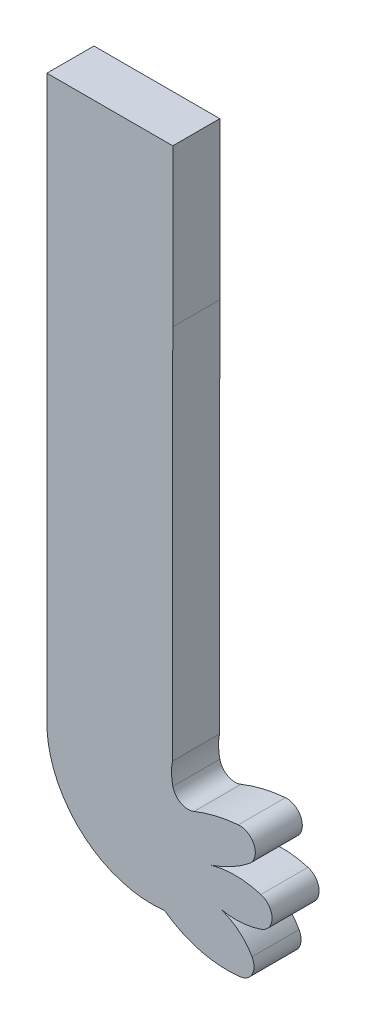
ISO-10303-21;
HEADER;
FILE_DESCRIPTION(('STEP AP214'),'2;1');
FILE_NAME('part.step','',(''),(''),'','','');
FILE_SCHEMA(('AUTOMOTIVE_DESIGN { 1 0 10303 214 1 1 1 1 }'));
ENDSEC;
DATA;
#1=APPLICATION_CONTEXT('core data for automotive mechanical design processes');
#2=APPLICATION_PROTOCOL_DEFINITION('international standard','automotive_design',2000,#1);
#3=PRODUCT_CONTEXT('',#1,'mechanical');
#4=PRODUCT('Part','Part','',(#3));
#5=PRODUCT_RELATED_PRODUCT_CATEGORY('part','',(#4));
#6=PRODUCT_DEFINITION_FORMATION('','',#4);
#7=PRODUCT_DEFINITION_CONTEXT('part definition',#1,'design');
#8=PRODUCT_DEFINITION('design','',#6,#7);
#9=PRODUCT_DEFINITION_SHAPE('','',#8);
#10=(LENGTH_UNIT() NAMED_UNIT(*) SI_UNIT(.MILLI.,.METRE.));
#11=(NAMED_UNIT(*) PLANE_ANGLE_UNIT() SI_UNIT($,.RADIAN.));
#12=(NAMED_UNIT(*) SI_UNIT($,.STERADIAN.) SOLID_ANGLE_UNIT());
#13=UNCERTAINTY_MEASURE_WITH_UNIT(LENGTH_MEASURE(1.E-05),#10,'distance_accuracy_value','');
#14=(GEOMETRIC_REPRESENTATION_CONTEXT(3) GLOBAL_UNCERTAINTY_ASSIGNED_CONTEXT((#13)) GLOBAL_UNIT_ASSIGNED_CONTEXT((#10,
#11,#12)) REPRESENTATION_CONTEXT('',''));
#15=CARTESIAN_POINT('',(0.,0.,0.));
#16=DIRECTION('',(0.,0.,1.));
#17=DIRECTION('',(1.,0.,0.));
#18=AXIS2_PLACEMENT_3D('',#15,#16,#17);
#19=CARTESIAN_POINT('',(59.8679410773858,6.18034957776012,3.));
#20=DIRECTION('',(0.,0.,-1.));
#21=DIRECTION('',(-1.,0.,0.));
#22=AXIS2_PLACEMENT_3D('',#19,#20,#21);
#23=CYLINDRICAL_SURFACE('',#22,3.53553390593273);
#24=CARTESIAN_POINT('',(59.8679410773858,6.18034957776012,0.));
#25=DIRECTION('',(0.,0.,1.));
#26=DIRECTION('',(1.,0.,0.));
#27=AXIS2_PLACEMENT_3D('',#24,#25,#26);
#28=CIRCLE('',#27,3.53553390593273);
#29=CARTESIAN_POINT('',(62.9495763407775,7.91341740777171,0.));
#30=VERTEX_POINT('',#29);
#31=CARTESIAN_POINT('',(60.8973528420917,9.56270251893659,0.));
#32=VERTEX_POINT('',#31);
#33=EDGE_CURVE('E177',#30,#32,#28,.T.);
#34=ORIENTED_EDGE('',*,*,#33,.T.);
#35=DIRECTION('',(0.,0.,-1.));
#36=VECTOR('',#35,1.);
#37=CARTESIAN_POINT('',(60.8973528420917,9.56270251893659,3.));
#38=LINE('',#37,#36);
#39=CARTESIAN_POINT('',(60.8973528420917,9.56270251893659,3.));
#40=VERTEX_POINT('',#39);
#41=EDGE_CURVE('E11',#40,#32,#38,.T.);
#42=ORIENTED_EDGE('',*,*,#41,.F.);
#43=CARTESIAN_POINT('',(59.8679410773858,6.18034957776012,3.));
#44=DIRECTION('',(0.,0.,1.));
#45=DIRECTION('',(1.,0.,0.));
#46=AXIS2_PLACEMENT_3D('',#43,#44,#45);
#47=CIRCLE('',#46,3.53553390593273);
#48=CARTESIAN_POINT('',(62.9495763407775,7.91341740777171,3.));
#49=VERTEX_POINT('',#48);
#50=EDGE_CURVE('E208',#49,#40,#47,.T.);
#51=ORIENTED_EDGE('',*,*,#50,.F.);
#52=DIRECTION('',(0.,0.,-1.));
#53=VECTOR('',#52,1.);
#54=CARTESIAN_POINT('',(62.9495763407775,7.91341740777171,3.));
#55=LINE('',#54,#53);
#56=EDGE_CURVE('E173',#49,#30,#55,.T.);
#57=ORIENTED_EDGE('',*,*,#56,.T.);
#58=EDGE_LOOP('',(#34,#42,#51,#57));
#59=FACE_BOUND('',#58,.T.);
#60=ADVANCED_FACE('F33',(#59),#23,.T.);
#61=CARTESIAN_POINT('',(61.9279452072724,14.2003681622498,3.));
#62=DIRECTION('',(0.,0.,-1.));
#63=DIRECTION('',(-1.,0.,0.));
#64=AXIS2_PLACEMENT_3D('',#61,#62,#63);
#65=CYLINDRICAL_SURFACE('',#64,4.75079606406509);
#66=CARTESIAN_POINT('',(61.9279452072724,14.2003681622498,0.));
#67=DIRECTION('',(0.,0.,1.));
#68=DIRECTION('',(1.,0.,0.));
#69=AXIS2_PLACEMENT_3D('',#66,#67,#68);
#70=CIRCLE('',#69,4.75079606406509);
#71=CARTESIAN_POINT('',(63.5166448777335,9.72308141697501,0.));
#72=VERTEX_POINT('',#71);
#73=EDGE_CURVE('E180',#32,#72,#70,.T.);
#74=ORIENTED_EDGE('',*,*,#73,.T.);
#75=DIRECTION('',(0.,0.,-1.));
#76=VECTOR('',#75,1.);
#77=CARTESIAN_POINT('',(63.5166448777335,9.72308141697501,3.));
#78=LINE('',#77,#76);
#79=CARTESIAN_POINT('',(63.5166448777335,9.72308141697501,3.));
#80=VERTEX_POINT('',#79);
#81=EDGE_CURVE('E41',#80,#72,#78,.T.);
#82=ORIENTED_EDGE('',*,*,#81,.F.);
#83=CARTESIAN_POINT('',(61.9279452072724,14.2003681622498,3.));
#84=DIRECTION('',(0.,0.,1.));
#85=DIRECTION('',(1.,0.,0.));
#86=AXIS2_PLACEMENT_3D('',#83,#84,#85);
#87=CIRCLE('',#86,4.75079606406509);
#88=EDGE_CURVE('E116',#40,#80,#87,.T.);
#89=ORIENTED_EDGE('',*,*,#88,.F.);
#90=ORIENTED_EDGE('',*,*,#41,.T.);
#91=EDGE_LOOP('',(#74,#82,#89,#90));
#92=FACE_BOUND('',#91,.T.);
#93=ADVANCED_FACE('F305',(#92),#65,.T.);
#94=CARTESIAN_POINT('',(63.2274430998222,10.6803495777602,3.));
#95=DIRECTION('',(0.,0.,-1.));
#96=DIRECTION('',(-1.,0.,0.));
#97=AXIS2_PLACEMENT_3D('',#94,#95,#96);
#98=CYLINDRICAL_SURFACE('',#97,1.00000000000002);
#99=CARTESIAN_POINT('',(63.2274430998222,10.6803495777602,0.));
#100=DIRECTION('',(0.,0.,1.));
#101=DIRECTION('',(1.,0.,0.));
#102=AXIS2_PLACEMENT_3D('',#99,#100,#101);
#103=CIRCLE('',#102,1.00000000000002);
#104=CARTESIAN_POINT('',(63.5166448777336,11.6376177385453,0.));
#105=VERTEX_POINT('',#104);
#106=EDGE_CURVE('E182',#72,#105,#103,.T.);
#107=ORIENTED_EDGE('',*,*,#106,.T.);
#108=DIRECTION('',(0.,0.,-1.));
#109=VECTOR('',#108,1.);
#110=CARTESIAN_POINT('',(63.5166448777336,11.6376177385453,3.));
#111=LINE('',#110,#109);
#112=CARTESIAN_POINT('',(63.5166448777336,11.6376177385453,3.));
#113=VERTEX_POINT('',#112);
#114=EDGE_CURVE('E239',#113,#105,#111,.T.);
#115=ORIENTED_EDGE('',*,*,#114,.F.);
#116=CARTESIAN_POINT('',(63.2274430998222,10.6803495777602,3.));
#117=DIRECTION('',(0.,0.,1.));
#118=DIRECTION('',(1.,0.,0.));
#119=AXIS2_PLACEMENT_3D('',#116,#117,#118);
#120=CIRCLE('',#119,1.00000000000002);
#121=EDGE_CURVE('E247',#80,#113,#120,.T.);
#122=ORIENTED_EDGE('',*,*,#121,.F.);
#123=ORIENTED_EDGE('',*,*,#81,.T.);
#124=EDGE_LOOP('',(#107,#115,#122,#123));
#125=FACE_BOUND('',#124,.T.);
#126=ADVANCED_FACE('F245',(#125),#98,.T.);
#127=CARTESIAN_POINT('',(61.8679410773859,6.18034957776009,3.));
#128=DIRECTION('',(0.,0.,-1.));
#129=DIRECTION('',(-1.,0.,0.));
#130=AXIS2_PLACEMENT_3D('',#127,#128,#129);
#131=CYLINDRICAL_SURFACE('',#130,5.70087712549574);
#132=CARTESIAN_POINT('',(61.8679410773859,6.18034957776009,0.));
#133=DIRECTION('',(0.,0.,1.));
#134=DIRECTION('',(1.,0.,0.));
#135=AXIS2_PLACEMENT_3D('',#132,#133,#134);
#136=CIRCLE('',#135,5.70087712549574);
#137=CARTESIAN_POINT('',(60.3679410773858,11.6803495777601,0.));
#138=VERTEX_POINT('',#137);
#139=EDGE_CURVE('E184',#105,#138,#136,.T.);
#140=ORIENTED_EDGE('',*,*,#139,.T.);
#141=DIRECTION('',(0.,0.,-1.));
#142=VECTOR('',#141,1.);
#143=CARTESIAN_POINT('',(60.3679410773858,11.6803495777601,3.));
#144=LINE('',#143,#142);
#145=CARTESIAN_POINT('',(60.3679410773858,11.6803495777601,3.));
#146=VERTEX_POINT('',#145);
#147=EDGE_CURVE('E236',#146,#138,#144,.T.);
#148=ORIENTED_EDGE('',*,*,#147,.F.);
#149=CARTESIAN_POINT('',(61.8679410773859,6.18034957776009,3.));
#150=DIRECTION('',(0.,0.,1.));
#151=DIRECTION('',(1.,0.,0.));
#152=AXIS2_PLACEMENT_3D('',#149,#150,#151);
#153=CIRCLE('',#152,5.70087712549574);
#154=EDGE_CURVE('E265',#113,#146,#153,.T.);
#155=ORIENTED_EDGE('',*,*,#154,.F.);
#156=ORIENTED_EDGE('',*,*,#114,.T.);
#157=EDGE_LOOP('',(#140,#148,#155,#156));
#158=FACE_BOUND('',#157,.T.);
#159=ADVANCED_FACE('F256',(#158),#131,.T.);
#160=CARTESIAN_POINT('',(57.8679410773858,19.18034957776,3.));
#161=DIRECTION('',(0.,0.,-1.));
#162=DIRECTION('',(-1.,0.,0.));
#163=AXIS2_PLACEMENT_3D('',#160,#161,#162);
#164=CYLINDRICAL_SURFACE('',#163,7.90569415042085);
#165=CARTESIAN_POINT('',(57.8679410773858,19.18034957776,0.));
#166=DIRECTION('',(0.,0.,1.));
#167=DIRECTION('',(1.,0.,0.));
#168=AXIS2_PLACEMENT_3D('',#165,#166,#167);
#169=CIRCLE('',#168,7.90569415042085);
#170=CARTESIAN_POINT('',(62.7790237950045,12.9850879577228,0.));
#171=VERTEX_POINT('',#170);
#172=EDGE_CURVE('E186',#138,#171,#169,.T.);
#173=ORIENTED_EDGE('',*,*,#172,.T.);
#174=DIRECTION('',(0.,0.,-1.));
#175=VECTOR('',#174,1.);
#176=CARTESIAN_POINT('',(62.7790237950045,12.9850879577228,3.));
#177=LINE('',#176,#175);
#178=CARTESIAN_POINT('',(62.7790237950045,12.9850879577228,3.));
#179=VERTEX_POINT('',#178);
#180=EDGE_CURVE('E233',#179,#171,#177,.T.);
#181=ORIENTED_EDGE('',*,*,#180,.F.);
#182=CARTESIAN_POINT('',(57.8679410773858,19.18034957776,3.));
#183=DIRECTION('',(0.,0.,1.));
#184=DIRECTION('',(1.,0.,0.));
#185=AXIS2_PLACEMENT_3D('',#182,#183,#184);
#186=CIRCLE('',#185,7.90569415042085);
#187=EDGE_CURVE('E262',#146,#179,#186,.T.);
#188=ORIENTED_EDGE('',*,*,#187,.F.);
#189=ORIENTED_EDGE('',*,*,#147,.T.);
#190=EDGE_LOOP('',(#173,#181,#188,#189));
#191=FACE_BOUND('',#190,.T.);
#192=ADVANCED_FACE('F260',(#191),#164,.T.);
#193=CARTESIAN_POINT('',(62.1578155083979,13.7687334545205,3.));
#194=DIRECTION('',(0.,0.,-1.));
#195=DIRECTION('',(-1.,0.,0.));
#196=AXIS2_PLACEMENT_3D('',#193,#194,#195);
#197=CYLINDRICAL_SURFACE('',#196,1.00000000000001);
#198=CARTESIAN_POINT('',(62.1578155083979,13.7687334545205,0.));
#199=DIRECTION('',(0.,0.,1.));
#200=DIRECTION('',(1.,0.,0.));
#201=AXIS2_PLACEMENT_3D('',#198,#199,#200);
#202=CIRCLE('',#201,1.00000000000001);
#203=CARTESIAN_POINT('',(62.0754122887833,14.7653325260619,0.));
#204=VERTEX_POINT('',#203);
#205=EDGE_CURVE('E188',#171,#204,#202,.T.);
#206=ORIENTED_EDGE('',*,*,#205,.T.);
#207=DIRECTION('',(0.,0.,-1.));
#208=VECTOR('',#207,1.);
#209=CARTESIAN_POINT('',(62.0754122887833,14.7653325260619,3.));
#210=LINE('',#209,#208);
#211=CARTESIAN_POINT('',(62.0754122887833,14.7653325260619,3.));
#212=VERTEX_POINT('',#211);
#213=EDGE_CURVE('E230',#212,#204,#210,.T.);
#214=ORIENTED_EDGE('',*,*,#213,.F.);
#215=CARTESIAN_POINT('',(62.1578155083979,13.7687334545205,3.));
#216=DIRECTION('',(0.,0.,1.));
#217=DIRECTION('',(1.,0.,0.));
#218=AXIS2_PLACEMENT_3D('',#215,#216,#217);
#219=CIRCLE('',#218,1.00000000000001);
#220=EDGE_CURVE('E264',#179,#212,#219,.T.);
#221=ORIENTED_EDGE('',*,*,#220,.F.);
#222=ORIENTED_EDGE('',*,*,#180,.T.);
#223=EDGE_LOOP('',(#206,#214,#221,#222));
#224=FACE_BOUND('',#223,.T.);
#225=ADVANCED_FACE('F318',(#224),#197,.T.);
#226=CARTESIAN_POINT('',(62.8679410773857,5.18034957776041,3.));
#227=DIRECTION('',(0.,0.,-1.));
#228=DIRECTION('',(-1.,0.,0.));
#229=AXIS2_PLACEMENT_3D('',#226,#227,#228);
#230=CYLINDRICAL_SURFACE('',#229,9.6176920308354);
#231=CARTESIAN_POINT('',(62.8679410773857,5.18034957776041,0.));
#232=DIRECTION('',(0.,0.,1.));
#233=DIRECTION('',(1.,0.,0.));
#234=AXIS2_PLACEMENT_3D('',#231,#232,#233);
#235=CIRCLE('',#234,9.6176920308354);
#236=CARTESIAN_POINT('',(59.2493463261999,14.0913412188004,0.));
#237=VERTEX_POINT('',#236);
#238=EDGE_CURVE('E190',#204,#237,#235,.T.);
#239=ORIENTED_EDGE('',*,*,#238,.T.);
#240=DIRECTION('',(0.,0.,-1.));
#241=VECTOR('',#240,1.);
#242=CARTESIAN_POINT('',(59.2493463261999,14.0913412188004,3.));
#243=LINE('',#242,#241);
#244=CARTESIAN_POINT('',(59.2493463261999,14.0913412188004,3.));
#245=VERTEX_POINT('',#244);
#246=EDGE_CURVE('E227',#245,#237,#243,.T.);
#247=ORIENTED_EDGE('',*,*,#246,.F.);
#248=CARTESIAN_POINT('',(62.8679410773857,5.18034957776041,3.));
#249=DIRECTION('',(0.,0.,1.));
#250=DIRECTION('',(1.,0.,0.));
#251=AXIS2_PLACEMENT_3D('',#248,#249,#250);
#252=CIRCLE('',#251,9.6176920308354);
#253=EDGE_CURVE('E267',#212,#245,#252,.T.);
#254=ORIENTED_EDGE('',*,*,#253,.F.);
#255=ORIENTED_EDGE('',*,*,#213,.T.);
#256=EDGE_LOOP('',(#239,#247,#254,#255));
#257=FACE_BOUND('',#256,.T.);
#258=ADVANCED_FACE('F321',(#257),#230,.T.);
#259=CARTESIAN_POINT('',(58.8731027596993,15.0178620111559,3.));
#260=DIRECTION('',(0.,0.,-1.));
#261=DIRECTION('',(-1.,0.,0.));
#262=AXIS2_PLACEMENT_3D('',#259,#260,#261);
#263=CYLINDRICAL_SURFACE('',#262,0.999999999999994);
#264=CARTESIAN_POINT('',(58.8731027596993,15.0178620111559,0.));
#265=DIRECTION('',(0.,0.,-1.));
#266=DIRECTION('',(1.,0.,0.));
#267=AXIS2_PLACEMENT_3D('',#264,#265,#266);
#268=CIRCLE('',#267,0.999999999999994);
#269=CARTESIAN_POINT('',(57.8972057886956,14.7996302490637,0.));
#270=VERTEX_POINT('',#269);
#271=EDGE_CURVE('E192',#237,#270,#268,.T.);
#272=ORIENTED_EDGE('',*,*,#271,.T.);
#273=DIRECTION('',(0.,0.,-1.));
#274=VECTOR('',#273,1.);
#275=CARTESIAN_POINT('',(57.8972057886956,14.7996302490637,3.));
#276=LINE('',#275,#274);
#277=CARTESIAN_POINT('',(57.8972057886956,14.7996302490637,3.));
#278=VERTEX_POINT('',#277);
#279=EDGE_CURVE('E224',#278,#270,#276,.T.);
#280=ORIENTED_EDGE('',*,*,#279,.F.);
#281=CARTESIAN_POINT('',(58.8731027596993,15.0178620111559,3.));
#282=DIRECTION('',(0.,0.,-1.));
#283=DIRECTION('',(1.,0.,0.));
#284=AXIS2_PLACEMENT_3D('',#281,#282,#283);
#285=CIRCLE('',#284,0.999999999999994);
#286=EDGE_CURVE('E273',#245,#278,#285,.T.);
#287=ORIENTED_EDGE('',*,*,#286,.F.);
#288=ORIENTED_EDGE('',*,*,#246,.T.);
#289=EDGE_LOOP('',(#272,#280,#287,#288));
#290=FACE_BOUND('',#289,.T.);
#291=ADVANCED_FACE('F325',(#290),#263,.F.);
#292=CARTESIAN_POINT('',(61.2413859750048,15.5474615842313,3.));
#293=DIRECTION('',(0.,0.,-1.));
#294=DIRECTION('',(-1.,0.,0.));
#295=AXIS2_PLACEMENT_3D('',#292,#293,#294);
#296=CYLINDRICAL_SURFACE('',#295,3.42677586433096);
#297=CARTESIAN_POINT('',(61.2413859750048,15.5474615842313,0.));
#298=DIRECTION('',(0.,0.,-1.));
#299=DIRECTION('',(1.,0.,0.));
#300=AXIS2_PLACEMENT_3D('',#297,#298,#299);
#301=CIRCLE('',#300,3.42677586433096);
#302=CARTESIAN_POINT('',(57.8760513314162,16.1934612444662,0.));
#303=VERTEX_POINT('',#302);
#304=EDGE_CURVE('E194',#270,#303,#301,.T.);
#305=ORIENTED_EDGE('',*,*,#304,.T.);
#306=DIRECTION('',(0.,0.,-1.));
#307=VECTOR('',#306,1.);
#308=CARTESIAN_POINT('',(57.8760513314162,16.1934612444662,3.));
#309=LINE('',#308,#307);
#310=CARTESIAN_POINT('',(57.8760513314162,16.1934612444662,3.));
#311=VERTEX_POINT('',#310);
#312=EDGE_CURVE('E221',#311,#303,#309,.T.);
#313=ORIENTED_EDGE('',*,*,#312,.F.);
#314=CARTESIAN_POINT('',(61.2413859750048,15.5474615842313,3.));
#315=DIRECTION('',(0.,0.,-1.));
#316=DIRECTION('',(1.,0.,0.));
#317=AXIS2_PLACEMENT_3D('',#314,#315,#316);
#318=CIRCLE('',#317,3.42677586433096);
#319=EDGE_CURVE('E275',#278,#311,#318,.T.);
#320=ORIENTED_EDGE('',*,*,#319,.F.);
#321=ORIENTED_EDGE('',*,*,#279,.T.);
#322=EDGE_LOOP('',(#305,#313,#320,#321));
#323=FACE_BOUND('',#322,.T.);
#324=ADVANCED_FACE('F329',(#323),#296,.F.);
#325=CARTESIAN_POINT('',(57.8760513314162,16.1934612444662,3.));
#326=DIRECTION('',(-0.99999972063611,0.000747480903381505,0.));
#327=DIRECTION('',(-0.000747480903381505,-0.999999720636111,0.));
#328=AXIS2_PLACEMENT_3D('',#325,#326,#327);
#329=PLANE('',#328);
#330=DIRECTION('',(0.000747480903381505,0.99999972063611,0.));
#331=VECTOR('',#330,1.);
#332=CARTESIAN_POINT('',(57.8760513314162,16.1934612444662,0.));
#333=LINE('',#332,#331);
#334=CARTESIAN_POINT('',(57.8939810773858,40.1803495777601,0.));
#335=VERTEX_POINT('',#334);
#336=EDGE_CURVE('E196',#303,#335,#333,.T.);
#337=ORIENTED_EDGE('',*,*,#336,.T.);
#338=DIRECTION('',(0.,0.,-1.));
#339=VECTOR('',#338,1.);
#340=CARTESIAN_POINT('',(57.8939810773858,40.1803495777601,3.));
#341=LINE('',#340,#339);
#342=CARTESIAN_POINT('',(57.8939810773858,40.1803495777601,3.));
#343=VERTEX_POINT('',#342);
#344=EDGE_CURVE('E218',#343,#335,#341,.T.);
#345=ORIENTED_EDGE('',*,*,#344,.F.);
#346=DIRECTION('',(0.000747480903381505,0.99999972063611,0.));
#347=VECTOR('',#346,1.);
#348=CARTESIAN_POINT('',(57.8760513314162,16.1934612444662,3.));
#349=LINE('',#348,#347);
#350=EDGE_CURVE('E277',#311,#343,#349,.T.);
#351=ORIENTED_EDGE('',*,*,#350,.F.);
#352=ORIENTED_EDGE('',*,*,#312,.T.);
#353=EDGE_LOOP('',(#337,#345,#351,#352));
#354=FACE_BOUND('',#353,.T.);
#355=ADVANCED_FACE('F333',(#354),#329,.F.);
#356=CARTESIAN_POINT('',(57.8939810773858,40.1803495777601,3.));
#357=DIRECTION('',(-1.,0.,0.));
#358=DIRECTION('',(0.,0.,1.));
#359=AXIS2_PLACEMENT_3D('',#356,#357,#358);
#360=PLANE('',#359);
#361=DIRECTION('',(0.,1.,0.));
#362=VECTOR('',#361,1.);
#363=CARTESIAN_POINT('',(57.8939810773858,40.1803495777601,0.));
#364=LINE('',#363,#362);
#365=CARTESIAN_POINT('',(57.8939810773858,50.1803495777601,0.));
#366=VERTEX_POINT('',#365);
#367=EDGE_CURVE('E198',#335,#366,#364,.T.);
#368=ORIENTED_EDGE('',*,*,#367,.T.);
#369=DIRECTION('',(0.,0.,-1.));
#370=VECTOR('',#369,1.);
#371=CARTESIAN_POINT('',(57.8939810773858,50.1803495777601,3.));
#372=LINE('',#371,#370);
#373=CARTESIAN_POINT('',(57.8939810773858,50.1803495777601,3.));
#374=VERTEX_POINT('',#373);
#375=EDGE_CURVE('E215',#374,#366,#372,.T.);
#376=ORIENTED_EDGE('',*,*,#375,.F.);
#377=DIRECTION('',(0.,1.,0.));
#378=VECTOR('',#377,1.);
#379=CARTESIAN_POINT('',(57.8939810773858,40.1803495777601,3.));
#380=LINE('',#379,#378);
#381=EDGE_CURVE('E279',#343,#374,#380,.T.);
#382=ORIENTED_EDGE('',*,*,#381,.F.);
#383=ORIENTED_EDGE('',*,*,#344,.T.);
#384=EDGE_LOOP('',(#368,#376,#382,#383));
#385=FACE_BOUND('',#384,.T.);
#386=ADVANCED_FACE('F337',(#385),#360,.F.);
#387=CARTESIAN_POINT('',(57.8939810773858,50.1803495777601,3.));
#388=DIRECTION('',(3.4642423751883E-12,-1.,0.));
#389=DIRECTION('',(1.,3.4642423751883E-12,0.));
#390=AXIS2_PLACEMENT_3D('',#387,#388,#389);
#391=PLANE('',#390);
#392=DIRECTION('',(-1.,-3.4642423751883E-12,0.));
#393=VECTOR('',#392,1.);
#394=CARTESIAN_POINT('',(57.8939810773858,50.1803495777601,0.));
#395=LINE('',#394,#393);
#396=CARTESIAN_POINT('',(49.8679410773858,50.1803495777323,0.));
#397=VERTEX_POINT('',#396);
#398=EDGE_CURVE('E200',#366,#397,#395,.T.);
#399=ORIENTED_EDGE('',*,*,#398,.T.);
#400=DIRECTION('',(0.,0.,-1.));
#401=VECTOR('',#400,1.);
#402=CARTESIAN_POINT('',(49.8679410773858,50.1803495777323,3.));
#403=LINE('',#402,#401);
#404=CARTESIAN_POINT('',(49.8679410773858,50.1803495777323,3.));
#405=VERTEX_POINT('',#404);
#406=EDGE_CURVE('E212',#405,#397,#403,.T.);
#407=ORIENTED_EDGE('',*,*,#406,.F.);
#408=DIRECTION('',(-1.,-3.4642423751883E-12,0.));
#409=VECTOR('',#408,1.);
#410=CARTESIAN_POINT('',(57.8939810773858,50.1803495777601,3.));
#411=LINE('',#410,#409);
#412=EDGE_CURVE('E281',#374,#405,#411,.T.);
#413=ORIENTED_EDGE('',*,*,#412,.F.);
#414=ORIENTED_EDGE('',*,*,#375,.T.);
#415=EDGE_LOOP('',(#399,#407,#413,#414));
#416=FACE_BOUND('',#415,.T.);
#417=ADVANCED_FACE('F287',(#416),#391,.F.);
#418=CARTESIAN_POINT('',(49.8679410773858,31.5970995777465,3.));
#419=DIRECTION('',(1.,0.,0.));
#420=DIRECTION('',(0.,0.,-1.));
#421=AXIS2_PLACEMENT_3D('',#418,#419,#420);
#422=PLANE('',#421);
#423=DIRECTION('',(0.,-1.,0.));
#424=VECTOR('',#423,1.);
#425=CARTESIAN_POINT('',(49.8679410773858,31.5970995777465,0.));
#426=LINE('',#425,#424);
#427=CARTESIAN_POINT('',(49.8679410773858,14.0138495777601,0.));
#428=VERTEX_POINT('',#427);
#429=EDGE_CURVE('E203',#397,#428,#426,.T.);
#430=ORIENTED_EDGE('',*,*,#429,.T.);
#431=DIRECTION('',(0.,0.,-1.));
#432=VECTOR('',#431,1.);
#433=CARTESIAN_POINT('',(49.8679410773858,14.0138495777601,3.));
#434=LINE('',#433,#432);
#435=CARTESIAN_POINT('',(49.8679410773858,14.0138495777601,3.));
#436=VERTEX_POINT('',#435);
#437=EDGE_CURVE('E168',#436,#428,#434,.T.);
#438=ORIENTED_EDGE('',*,*,#437,.F.);
#439=DIRECTION('',(0.,-1.,0.));
#440=VECTOR('',#439,1.);
#441=CARTESIAN_POINT('',(49.8679410773858,50.1803495777323,3.));
#442=LINE('',#441,#440);
#443=EDGE_CURVE('E159',#405,#436,#442,.T.);
#444=ORIENTED_EDGE('',*,*,#443,.F.);
#445=ORIENTED_EDGE('',*,*,#406,.T.);
#446=EDGE_LOOP('',(#430,#438,#444,#445));
#447=FACE_BOUND('',#446,.T.);
#448=ADVANCED_FACE('F290',(#447),#422,.F.);
#449=CARTESIAN_POINT('',(56.5484606948639,14.3173604336985,3.));
#450=DIRECTION('',(0.,0.,-1.));
#451=DIRECTION('',(-1.,0.,0.));
#452=AXIS2_PLACEMENT_3D('',#449,#450,#451);
#453=CYLINDRICAL_SURFACE('',#452,6.68741064980927);
#454=CARTESIAN_POINT('',(56.5484606948639,14.3173604336985,0.));
#455=DIRECTION('',(0.,0.,1.));
#456=DIRECTION('',(1.,0.,0.));
#457=AXIS2_PLACEMENT_3D('',#454,#455,#456);
#458=CIRCLE('',#457,6.68741064980927);
#459=CARTESIAN_POINT('',(57.3679410773858,7.68034957776012,0.));
#460=VERTEX_POINT('',#459);
#461=EDGE_CURVE('E167',#428,#460,#458,.T.);
#462=ORIENTED_EDGE('',*,*,#461,.T.);
#463=DIRECTION('',(0.,0.,-1.));
#464=VECTOR('',#463,1.);
#465=CARTESIAN_POINT('',(57.3679410773858,7.68034957776012,3.));
#466=LINE('',#465,#464);
#467=CARTESIAN_POINT('',(57.3679410773858,7.68034957776012,3.));
#468=VERTEX_POINT('',#467);
#469=EDGE_CURVE('E164',#468,#460,#466,.T.);
#470=ORIENTED_EDGE('',*,*,#469,.F.);
#471=CARTESIAN_POINT('',(56.5484606948639,14.3173604336985,3.));
#472=DIRECTION('',(0.,0.,1.));
#473=DIRECTION('',(1.,0.,0.));
#474=AXIS2_PLACEMENT_3D('',#471,#472,#473);
#475=CIRCLE('',#474,6.68741064980927);
#476=EDGE_CURVE('E153',#436,#468,#475,.T.);
#477=ORIENTED_EDGE('',*,*,#476,.F.);
#478=ORIENTED_EDGE('',*,*,#437,.T.);
#479=EDGE_LOOP('',(#462,#470,#477,#478));
#480=FACE_BOUND('',#479,.T.);
#481=ADVANCED_FACE('F165',(#480),#453,.T.);
#482=CARTESIAN_POINT('',(61.3679410773858,13.1803495777599,3.));
#483=DIRECTION('',(0.,0.,-1.));
#484=DIRECTION('',(-1.,0.,0.));
#485=AXIS2_PLACEMENT_3D('',#482,#483,#484);
#486=CYLINDRICAL_SURFACE('',#485,6.80073525436755);
#487=CARTESIAN_POINT('',(61.3679410773858,13.1803495777599,0.));
#488=DIRECTION('',(0.,0.,1.));
#489=DIRECTION('',(1.,0.,0.));
#490=AXIS2_PLACEMENT_3D('',#487,#488,#489);
#491=CIRCLE('',#490,6.80073525436755);
#492=CARTESIAN_POINT('',(62.2003595037792,6.43075110352471,0.));
#493=VERTEX_POINT('',#492);
#494=EDGE_CURVE('E102',#460,#493,#491,.T.);
#495=ORIENTED_EDGE('',*,*,#494,.T.);
#496=DIRECTION('',(0.,0.,-1.));
#497=VECTOR('',#496,1.);
#498=CARTESIAN_POINT('',(62.2003595037792,6.43075110352471,3.));
#499=LINE('',#498,#497);
#500=CARTESIAN_POINT('',(62.2003595037792,6.43075110352471,3.));
#501=VERTEX_POINT('',#500);
#502=EDGE_CURVE('E169',#501,#493,#499,.T.);
#503=ORIENTED_EDGE('',*,*,#502,.F.);
#504=CARTESIAN_POINT('',(61.3679410773858,13.1803495777599,3.));
#505=DIRECTION('',(0.,0.,1.));
#506=DIRECTION('',(1.,0.,0.));
#507=AXIS2_PLACEMENT_3D('',#504,#505,#506);
#508=CIRCLE('',#507,6.80073525436755);
#509=EDGE_CURVE('E157',#468,#501,#508,.T.);
#510=ORIENTED_EDGE('',*,*,#509,.F.);
#511=ORIENTED_EDGE('',*,*,#469,.T.);
#512=EDGE_LOOP('',(#495,#503,#510,#511));
#513=FACE_BOUND('',#512,.T.);
#514=ADVANCED_FACE('F171',(#513),#486,.T.);
#515=CARTESIAN_POINT('',(62.0779582640223,7.42323180182875,3.));
#516=DIRECTION('',(0.,0.,-1.));
#517=DIRECTION('',(-1.,0.,0.));
#518=AXIS2_PLACEMENT_3D('',#515,#516,#517);
#519=CYLINDRICAL_SURFACE('',#518,1.00000000000004);
#520=CARTESIAN_POINT('',(62.0779582640223,7.42323180182875,0.));
#521=DIRECTION('',(0.,0.,1.));
#522=DIRECTION('',(1.,0.,0.));
#523=AXIS2_PLACEMENT_3D('',#520,#521,#522);
#524=CIRCLE('',#523,1.00000000000004);
#525=EDGE_CURVE('E108',#493,#30,#524,.T.);
#526=ORIENTED_EDGE('',*,*,#525,.T.);
#527=ORIENTED_EDGE('',*,*,#56,.F.);
#528=CARTESIAN_POINT('',(62.0779582640223,7.42323180182875,3.));
#529=DIRECTION('',(0.,0.,1.));
#530=DIRECTION('',(1.,0.,0.));
#531=AXIS2_PLACEMENT_3D('',#528,#529,#530);
#532=CIRCLE('',#531,1.00000000000004);
#533=EDGE_CURVE('E49',#501,#49,#532,.T.);
#534=ORIENTED_EDGE('',*,*,#533,.F.);
#535=ORIENTED_EDGE('',*,*,#502,.T.);
#536=EDGE_LOOP('',(#526,#527,#534,#535));
#537=FACE_BOUND('',#536,.T.);
#538=ADVANCED_FACE('F294',(#537),#519,.T.);
#539=CARTESIAN_POINT('',(59.8679410773858,6.18034957776012,3.));
#540=DIRECTION('',(0.,0.,1.));
#541=DIRECTION('',(1.,0.,0.));
#542=AXIS2_PLACEMENT_3D('',#539,#540,#541);
#543=PLANE('',#542);
#544=ORIENTED_EDGE('',*,*,#50,.T.);
#545=ORIENTED_EDGE('',*,*,#88,.T.);
#546=ORIENTED_EDGE('',*,*,#121,.T.);
#547=ORIENTED_EDGE('',*,*,#154,.T.);
#548=ORIENTED_EDGE('',*,*,#187,.T.);
#549=ORIENTED_EDGE('',*,*,#220,.T.);
#550=ORIENTED_EDGE('',*,*,#253,.T.);
#551=ORIENTED_EDGE('',*,*,#286,.T.);
#552=ORIENTED_EDGE('',*,*,#319,.T.);
#553=ORIENTED_EDGE('',*,*,#350,.T.);
#554=ORIENTED_EDGE('',*,*,#381,.T.);
#555=ORIENTED_EDGE('',*,*,#412,.T.);
#556=ORIENTED_EDGE('',*,*,#443,.T.);
#557=ORIENTED_EDGE('',*,*,#476,.T.);
#558=ORIENTED_EDGE('',*,*,#509,.T.);
#559=ORIENTED_EDGE('',*,*,#533,.T.);
#560=EDGE_LOOP('',(#544,#545,#546,#547,#548,#549,#550,#551,#552,#553,#554,#555,#556,#557,#558,#559));
#561=FACE_BOUND('',#560,.T.);
#562=ADVANCED_FACE('F155',(#561),#543,.T.);
#563=CARTESIAN_POINT('',(59.8679410773858,6.18034957776012,0.));
#564=DIRECTION('',(0.,0.,1.));
#565=DIRECTION('',(1.,0.,0.));
#566=AXIS2_PLACEMENT_3D('',#563,#564,#565);
#567=PLANE('',#566);
#568=ORIENTED_EDGE('',*,*,#33,.F.);
#569=ORIENTED_EDGE('',*,*,#525,.F.);
#570=ORIENTED_EDGE('',*,*,#494,.F.);
#571=ORIENTED_EDGE('',*,*,#461,.F.);
#572=ORIENTED_EDGE('',*,*,#429,.F.);
#573=ORIENTED_EDGE('',*,*,#398,.F.);
#574=ORIENTED_EDGE('',*,*,#367,.F.);
#575=ORIENTED_EDGE('',*,*,#336,.F.);
#576=ORIENTED_EDGE('',*,*,#304,.F.);
#577=ORIENTED_EDGE('',*,*,#271,.F.);
#578=ORIENTED_EDGE('',*,*,#238,.F.);
#579=ORIENTED_EDGE('',*,*,#205,.F.);
#580=ORIENTED_EDGE('',*,*,#172,.F.);
#581=ORIENTED_EDGE('',*,*,#139,.F.);
#582=ORIENTED_EDGE('',*,*,#106,.F.);
#583=ORIENTED_EDGE('',*,*,#73,.F.);
#584=EDGE_LOOP('',(#568,#569,#570,#571,#572,#573,#574,#575,#576,#577,#578,#579,#580,#581,#582,#583));
#585=FACE_BOUND('',#584,.T.);
#586=ADVANCED_FACE('F251',(#585),#567,.F.);
#587=CLOSED_SHELL('',(#60,#93,#126,#159,#192,#225,#258,#291,#324,#355,#386,#417,#448,#481,#514,
#538,#562,#586));
#588=MANIFOLD_SOLID_BREP('B2',#587);
#589=ADVANCED_BREP_SHAPE_REPRESENTATION('',(#18,#588),#14);
#590=SHAPE_DEFINITION_REPRESENTATION(#9,#589);
ENDSEC;
END-ISO-10303-21;
